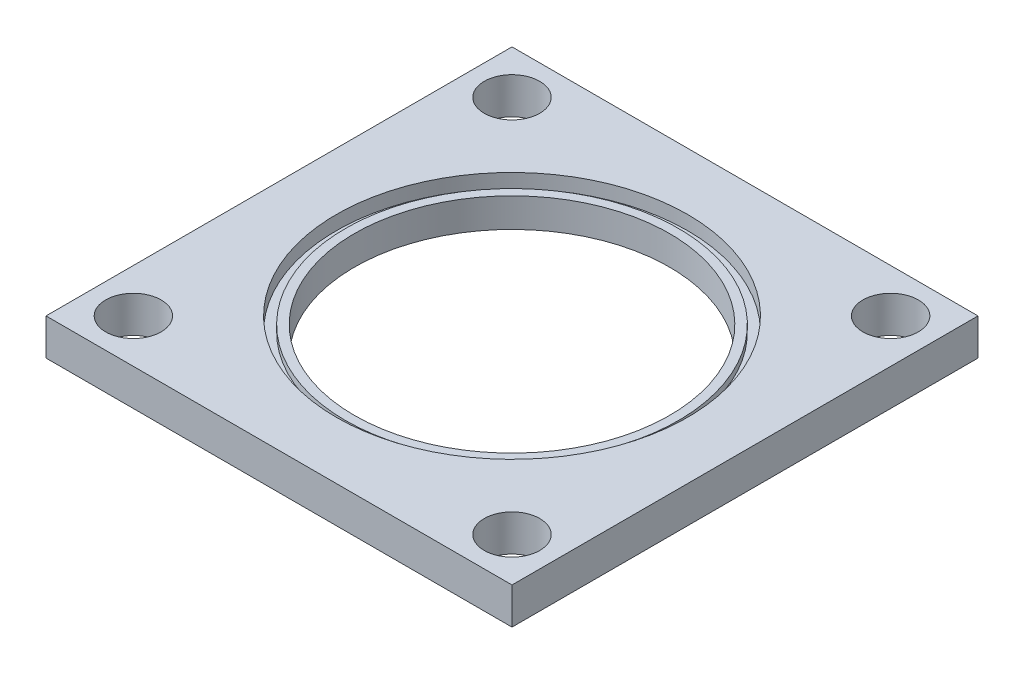
ISO-10303-21;
HEADER;
FILE_DESCRIPTION(('STEP AP214'),'2;1');
FILE_NAME('part.step','',(''),(''),'','','');
FILE_SCHEMA(('AUTOMOTIVE_DESIGN { 1 0 10303 214 1 1 1 1 }'));
ENDSEC;
DATA;
#1=APPLICATION_CONTEXT('core data for automotive mechanical design processes');
#2=APPLICATION_PROTOCOL_DEFINITION('international standard','automotive_design',2000,#1);
#3=PRODUCT_CONTEXT('',#1,'mechanical');
#4=PRODUCT('Part','Part','',(#3));
#5=PRODUCT_RELATED_PRODUCT_CATEGORY('part','',(#4));
#6=PRODUCT_DEFINITION_FORMATION('','',#4);
#7=PRODUCT_DEFINITION_CONTEXT('part definition',#1,'design');
#8=PRODUCT_DEFINITION('design','',#6,#7);
#9=PRODUCT_DEFINITION_SHAPE('','',#8);
#10=(LENGTH_UNIT() NAMED_UNIT(*) SI_UNIT(.MILLI.,.METRE.));
#11=(NAMED_UNIT(*) PLANE_ANGLE_UNIT() SI_UNIT($,.RADIAN.));
#12=(NAMED_UNIT(*) SI_UNIT($,.STERADIAN.) SOLID_ANGLE_UNIT());
#13=UNCERTAINTY_MEASURE_WITH_UNIT(LENGTH_MEASURE(1.E-05),#10,'distance_accuracy_value','');
#14=(GEOMETRIC_REPRESENTATION_CONTEXT(3) GLOBAL_UNCERTAINTY_ASSIGNED_CONTEXT((#13)) GLOBAL_UNIT_ASSIGNED_CONTEXT((#10,
#11,#12)) REPRESENTATION_CONTEXT('',''));
#15=CARTESIAN_POINT('',(0.,0.,0.));
#16=DIRECTION('',(0.,0.,1.));
#17=DIRECTION('',(1.,0.,0.));
#18=AXIS2_PLACEMENT_3D('',#15,#16,#17);
#19=CARTESIAN_POINT('',(0.,5.,0.));
#20=DIRECTION('',(0.,1.,0.));
#21=DIRECTION('',(0.,0.,1.));
#22=AXIS2_PLACEMENT_3D('',#19,#20,#21);
#23=PLANE('',#22);
#24=CARTESIAN_POINT('',(0.,5.,0.));
#25=DIRECTION('',(0.,1.,0.));
#26=DIRECTION('',(0.,0.,1.));
#27=AXIS2_PLACEMENT_3D('',#24,#25,#26);
#28=CIRCLE('',#27,27.051);
#29=CARTESIAN_POINT('',(0.,5.,27.051));
#30=VERTEX_POINT('',#29);
#31=EDGE_CURVE('E163',#30,#30,#28,.T.);
#32=ORIENTED_EDGE('',*,*,#31,.F.);
#33=EDGE_LOOP('',(#32));
#34=FACE_BOUND('',#33,.T.);
#35=CARTESIAN_POINT('',(0.,5.,0.));
#36=DIRECTION('',(0.,1.,0.));
#37=DIRECTION('',(0.,0.,1.));
#38=AXIS2_PLACEMENT_3D('',#35,#36,#37);
#39=CIRCLE('',#38,28.575);
#40=CARTESIAN_POINT('',(0.,5.,28.575));
#41=VERTEX_POINT('',#40);
#42=EDGE_CURVE('E208',#41,#41,#39,.T.);
#43=ORIENTED_EDGE('',*,*,#42,.T.);
#44=EDGE_LOOP('',(#43));
#45=FACE_BOUND('',#44,.T.);
#46=ADVANCED_FACE('F51',(#34,#45),#23,.T.);
#47=CARTESIAN_POINT('',(0.,0.,0.));
#48=DIRECTION('',(0.,-1.,0.));
#49=DIRECTION('',(0.,0.,-1.));
#50=AXIS2_PLACEMENT_3D('',#47,#48,#49);
#51=PLANE('',#50);
#52=CARTESIAN_POINT('',(-32.5,0.,32.5));
#53=DIRECTION('',(0.,1.,0.));
#54=DIRECTION('',(0.,0.,1.));
#55=AXIS2_PLACEMENT_3D('',#52,#53,#54);
#56=CIRCLE('',#55,4.7625);
#57=CARTESIAN_POINT('',(-32.5,0.,37.2625));
#58=VERTEX_POINT('',#57);
#59=EDGE_CURVE('E174',#58,#58,#56,.T.);
#60=ORIENTED_EDGE('',*,*,#59,.T.);
#61=EDGE_LOOP('',(#60));
#62=FACE_BOUND('',#61,.T.);
#63=CARTESIAN_POINT('',(32.5,0.,-32.5));
#64=DIRECTION('',(0.,1.,0.));
#65=DIRECTION('',(0.,0.,1.));
#66=AXIS2_PLACEMENT_3D('',#63,#64,#65);
#67=CIRCLE('',#66,4.7625);
#68=CARTESIAN_POINT('',(32.5,0.,-27.7375));
#69=VERTEX_POINT('',#68);
#70=EDGE_CURVE('E186',#69,#69,#67,.T.);
#71=ORIENTED_EDGE('',*,*,#70,.T.);
#72=EDGE_LOOP('',(#71));
#73=FACE_BOUND('',#72,.T.);
#74=DIRECTION('',(0.,0.,-1.));
#75=VECTOR('',#74,1.);
#76=CARTESIAN_POINT('',(-40.,0.,40.));
#77=LINE('',#76,#75);
#78=CARTESIAN_POINT('',(-40.,0.,40.));
#79=VERTEX_POINT('',#78);
#80=CARTESIAN_POINT('',(-40.,0.,-40.));
#81=VERTEX_POINT('',#80);
#82=EDGE_CURVE('E130',#79,#81,#77,.T.);
#83=ORIENTED_EDGE('',*,*,#82,.T.);
#84=DIRECTION('',(1.,0.,0.));
#85=VECTOR('',#84,1.);
#86=CARTESIAN_POINT('',(-40.,0.,-40.));
#87=LINE('',#86,#85);
#88=CARTESIAN_POINT('',(40.,0.,-40.));
#89=VERTEX_POINT('',#88);
#90=EDGE_CURVE('E134',#81,#89,#87,.T.);
#91=ORIENTED_EDGE('',*,*,#90,.T.);
#92=DIRECTION('',(0.,0.,-1.));
#93=VECTOR('',#92,1.);
#94=CARTESIAN_POINT('',(40.,0.,40.));
#95=LINE('',#94,#93);
#96=CARTESIAN_POINT('',(40.,0.,40.));
#97=VERTEX_POINT('',#96);
#98=EDGE_CURVE('E115',#97,#89,#95,.T.);
#99=ORIENTED_EDGE('',*,*,#98,.F.);
#100=DIRECTION('',(1.,0.,0.));
#101=VECTOR('',#100,1.);
#102=CARTESIAN_POINT('',(-40.,0.,40.));
#103=LINE('',#102,#101);
#104=EDGE_CURVE('E87',#79,#97,#103,.T.);
#105=ORIENTED_EDGE('',*,*,#104,.F.);
#106=EDGE_LOOP('',(#83,#91,#99,#105));
#107=FACE_BOUND('',#106,.T.);
#108=CARTESIAN_POINT('',(-32.5,0.,-32.5));
#109=DIRECTION('',(0.,1.,0.));
#110=DIRECTION('',(0.,0.,1.));
#111=AXIS2_PLACEMENT_3D('',#108,#109,#110);
#112=CIRCLE('',#111,4.7625);
#113=CARTESIAN_POINT('',(-32.5,0.,-27.7375));
#114=VERTEX_POINT('',#113);
#115=EDGE_CURVE('E153',#114,#114,#112,.T.);
#116=ORIENTED_EDGE('',*,*,#115,.T.);
#117=EDGE_LOOP('',(#116));
#118=FACE_BOUND('',#117,.T.);
#119=CARTESIAN_POINT('',(32.5,0.,32.5));
#120=DIRECTION('',(0.,1.,0.));
#121=DIRECTION('',(0.,0.,1.));
#122=AXIS2_PLACEMENT_3D('',#119,#120,#121);
#123=CIRCLE('',#122,4.7625);
#124=CARTESIAN_POINT('',(32.5,0.,37.2625));
#125=VERTEX_POINT('',#124);
#126=EDGE_CURVE('E157',#125,#125,#123,.T.);
#127=ORIENTED_EDGE('',*,*,#126,.T.);
#128=EDGE_LOOP('',(#127));
#129=FACE_BOUND('',#128,.T.);
#130=CARTESIAN_POINT('',(0.,0.,0.));
#131=DIRECTION('',(0.,1.,0.));
#132=DIRECTION('',(0.,0.,1.));
#133=AXIS2_PLACEMENT_3D('',#130,#131,#132);
#134=CIRCLE('',#133,27.051);
#135=CARTESIAN_POINT('',(0.,0.,27.051));
#136=VERTEX_POINT('',#135);
#137=EDGE_CURVE('E160',#136,#136,#134,.T.);
#138=ORIENTED_EDGE('',*,*,#137,.T.);
#139=EDGE_LOOP('',(#138));
#140=FACE_BOUND('',#139,.T.);
#141=ADVANCED_FACE('F145',(#62,#73,#107,#118,#129,#140),#51,.T.);
#142=CARTESIAN_POINT('',(0.,6.2738,0.));
#143=DIRECTION('',(0.,-1.,0.));
#144=DIRECTION('',(0.,0.,-1.));
#145=AXIS2_PLACEMENT_3D('',#142,#143,#144);
#146=PLANE('',#145);
#147=CARTESIAN_POINT('',(-32.5,6.2738,32.5));
#148=DIRECTION('',(0.,-1.,0.));
#149=DIRECTION('',(0.,0.,-1.));
#150=AXIS2_PLACEMENT_3D('',#147,#148,#149);
#151=CIRCLE('',#150,4.7625);
#152=CARTESIAN_POINT('',(-32.5,6.2738,27.7375));
#153=VERTEX_POINT('',#152);
#154=EDGE_CURVE('E177',#153,#153,#151,.F.);
#155=ORIENTED_EDGE('',*,*,#154,.F.);
#156=EDGE_LOOP('',(#155));
#157=FACE_BOUND('',#156,.T.);
#158=CARTESIAN_POINT('',(32.5,6.2738,-32.5));
#159=DIRECTION('',(0.,-1.,0.));
#160=DIRECTION('',(0.,0.,-1.));
#161=AXIS2_PLACEMENT_3D('',#158,#159,#160);
#162=CIRCLE('',#161,4.7625);
#163=CARTESIAN_POINT('',(32.5,6.2738,-37.2625));
#164=VERTEX_POINT('',#163);
#165=EDGE_CURVE('E189',#164,#164,#162,.F.);
#166=ORIENTED_EDGE('',*,*,#165,.F.);
#167=EDGE_LOOP('',(#166));
#168=FACE_BOUND('',#167,.T.);
#169=DIRECTION('',(0.,0.,-1.));
#170=VECTOR('',#169,1.);
#171=CARTESIAN_POINT('',(-40.,6.2738,40.));
#172=LINE('',#171,#170);
#173=CARTESIAN_POINT('',(-40.,6.2738,40.));
#174=VERTEX_POINT('',#173);
#175=CARTESIAN_POINT('',(-40.,6.2738,-40.));
#176=VERTEX_POINT('',#175);
#177=EDGE_CURVE('E120',#174,#176,#172,.T.);
#178=ORIENTED_EDGE('',*,*,#177,.F.);
#179=DIRECTION('',(1.,0.,0.));
#180=VECTOR('',#179,1.);
#181=CARTESIAN_POINT('',(-40.,6.2738,40.));
#182=LINE('',#181,#180);
#183=CARTESIAN_POINT('',(40.,6.2738,40.));
#184=VERTEX_POINT('',#183);
#185=EDGE_CURVE('E107',#174,#184,#182,.T.);
#186=ORIENTED_EDGE('',*,*,#185,.T.);
#187=DIRECTION('',(0.,0.,-1.));
#188=VECTOR('',#187,1.);
#189=CARTESIAN_POINT('',(40.,6.2738,40.));
#190=LINE('',#189,#188);
#191=CARTESIAN_POINT('',(40.,6.2738,-40.));
#192=VERTEX_POINT('',#191);
#193=EDGE_CURVE('E101',#184,#192,#190,.T.);
#194=ORIENTED_EDGE('',*,*,#193,.T.);
#195=DIRECTION('',(1.,0.,0.));
#196=VECTOR('',#195,1.);
#197=CARTESIAN_POINT('',(-40.,6.2738,-40.));
#198=LINE('',#197,#196);
#199=EDGE_CURVE('E106',#176,#192,#198,.T.);
#200=ORIENTED_EDGE('',*,*,#199,.F.);
#201=EDGE_LOOP('',(#178,#186,#194,#200));
#202=FACE_BOUND('',#201,.T.);
#203=CARTESIAN_POINT('',(-32.5,6.2738,-32.5));
#204=DIRECTION('',(0.,-1.,0.));
#205=DIRECTION('',(0.,0.,-1.));
#206=AXIS2_PLACEMENT_3D('',#203,#204,#205);
#207=CIRCLE('',#206,4.7625);
#208=CARTESIAN_POINT('',(-32.5,6.2738,-37.2625));
#209=VERTEX_POINT('',#208);
#210=EDGE_CURVE('E135',#209,#209,#207,.F.);
#211=ORIENTED_EDGE('',*,*,#210,.F.);
#212=EDGE_LOOP('',(#211));
#213=FACE_BOUND('',#212,.T.);
#214=CARTESIAN_POINT('',(32.5,6.2738,32.5));
#215=DIRECTION('',(0.,-1.,0.));
#216=DIRECTION('',(0.,0.,-1.));
#217=AXIS2_PLACEMENT_3D('',#214,#215,#216);
#218=CIRCLE('',#217,4.7625);
#219=CARTESIAN_POINT('',(32.5,6.2738,27.7375));
#220=VERTEX_POINT('',#219);
#221=EDGE_CURVE('E182',#220,#220,#218,.F.);
#222=ORIENTED_EDGE('',*,*,#221,.F.);
#223=EDGE_LOOP('',(#222));
#224=FACE_BOUND('',#223,.T.);
#225=CARTESIAN_POINT('',(0.,6.2738,0.));
#226=DIRECTION('',(0.,-1.,0.));
#227=DIRECTION('',(0.,0.,-1.));
#228=AXIS2_PLACEMENT_3D('',#225,#226,#227);
#229=CIRCLE('',#228,30.1625);
#230=CARTESIAN_POINT('',(0.,6.2738,-30.1625));
#231=VERTEX_POINT('',#230);
#232=EDGE_CURVE('E55',#231,#231,#229,.F.);
#233=ORIENTED_EDGE('',*,*,#232,.F.);
#234=EDGE_LOOP('',(#233));
#235=FACE_BOUND('',#234,.T.);
#236=ADVANCED_FACE('F104',(#157,#168,#202,#213,#224,#235),#146,.F.);
#237=CARTESIAN_POINT('',(-40.,6.2738,40.));
#238=DIRECTION('',(-1.,0.,0.));
#239=DIRECTION('',(0.,0.,1.));
#240=AXIS2_PLACEMENT_3D('',#237,#238,#239);
#241=PLANE('',#240);
#242=ORIENTED_EDGE('',*,*,#82,.F.);
#243=DIRECTION('',(0.,-1.,0.));
#244=VECTOR('',#243,1.);
#245=CARTESIAN_POINT('',(-40.,6.2738,40.));
#246=LINE('',#245,#244);
#247=EDGE_CURVE('E13',#174,#79,#246,.T.);
#248=ORIENTED_EDGE('',*,*,#247,.F.);
#249=ORIENTED_EDGE('',*,*,#177,.T.);
#250=DIRECTION('',(0.,-1.,0.));
#251=VECTOR('',#250,1.);
#252=CARTESIAN_POINT('',(-40.,6.2738,-40.));
#253=LINE('',#252,#251);
#254=EDGE_CURVE('E96',#176,#81,#253,.T.);
#255=ORIENTED_EDGE('',*,*,#254,.T.);
#256=EDGE_LOOP('',(#242,#248,#249,#255));
#257=FACE_BOUND('',#256,.T.);
#258=ADVANCED_FACE('F53',(#257),#241,.T.);
#259=CARTESIAN_POINT('',(-40.,6.2738,40.));
#260=DIRECTION('',(0.,0.,-1.));
#261=DIRECTION('',(-1.,0.,0.));
#262=AXIS2_PLACEMENT_3D('',#259,#260,#261);
#263=PLANE('',#262);
#264=ORIENTED_EDGE('',*,*,#104,.T.);
#265=DIRECTION('',(0.,-1.,0.));
#266=VECTOR('',#265,1.);
#267=CARTESIAN_POINT('',(40.,6.2738,40.));
#268=LINE('',#267,#266);
#269=EDGE_CURVE('E61',#184,#97,#268,.T.);
#270=ORIENTED_EDGE('',*,*,#269,.F.);
#271=ORIENTED_EDGE('',*,*,#185,.F.);
#272=ORIENTED_EDGE('',*,*,#247,.T.);
#273=EDGE_LOOP('',(#264,#270,#271,#272));
#274=FACE_BOUND('',#273,.T.);
#275=ADVANCED_FACE('F295',(#274),#263,.F.);
#276=CARTESIAN_POINT('',(40.,6.2738,40.));
#277=DIRECTION('',(-1.,0.,0.));
#278=DIRECTION('',(0.,0.,1.));
#279=AXIS2_PLACEMENT_3D('',#276,#277,#278);
#280=PLANE('',#279);
#281=ORIENTED_EDGE('',*,*,#98,.T.);
#282=DIRECTION('',(0.,-1.,0.));
#283=VECTOR('',#282,1.);
#284=CARTESIAN_POINT('',(40.,6.2738,-40.));
#285=LINE('',#284,#283);
#286=EDGE_CURVE('E112',#192,#89,#285,.T.);
#287=ORIENTED_EDGE('',*,*,#286,.F.);
#288=ORIENTED_EDGE('',*,*,#193,.F.);
#289=ORIENTED_EDGE('',*,*,#269,.T.);
#290=EDGE_LOOP('',(#281,#287,#288,#289));
#291=FACE_BOUND('',#290,.T.);
#292=ADVANCED_FACE('F113',(#291),#280,.F.);
#293=CARTESIAN_POINT('',(-40.,6.2738,-40.));
#294=DIRECTION('',(0.,0.,-1.));
#295=DIRECTION('',(-1.,0.,0.));
#296=AXIS2_PLACEMENT_3D('',#293,#294,#295);
#297=PLANE('',#296);
#298=ORIENTED_EDGE('',*,*,#90,.F.);
#299=ORIENTED_EDGE('',*,*,#254,.F.);
#300=ORIENTED_EDGE('',*,*,#199,.T.);
#301=ORIENTED_EDGE('',*,*,#286,.T.);
#302=EDGE_LOOP('',(#298,#299,#300,#301));
#303=FACE_BOUND('',#302,.T.);
#304=ADVANCED_FACE('F118',(#303),#297,.T.);
#305=CARTESIAN_POINT('',(-32.5,10.,-32.5));
#306=DIRECTION('',(0.,-1.,0.));
#307=DIRECTION('',(0.,0.,-1.));
#308=AXIS2_PLACEMENT_3D('',#305,#306,#307);
#309=CYLINDRICAL_SURFACE('',#308,4.7625);
#310=ORIENTED_EDGE('',*,*,#115,.F.);
#311=EDGE_LOOP('',(#310));
#312=FACE_BOUND('',#311,.T.);
#313=ORIENTED_EDGE('',*,*,#210,.T.);
#314=EDGE_LOOP('',(#313));
#315=FACE_BOUND('',#314,.T.);
#316=ADVANCED_FACE('F196',(#312,#315),#309,.F.);
#317=CARTESIAN_POINT('',(32.5,10.,-32.5));
#318=DIRECTION('',(0.,-1.,0.));
#319=DIRECTION('',(0.,0.,-1.));
#320=AXIS2_PLACEMENT_3D('',#317,#318,#319);
#321=CYLINDRICAL_SURFACE('',#320,4.7625);
#322=ORIENTED_EDGE('',*,*,#70,.F.);
#323=EDGE_LOOP('',(#322));
#324=FACE_BOUND('',#323,.T.);
#325=ORIENTED_EDGE('',*,*,#165,.T.);
#326=EDGE_LOOP('',(#325));
#327=FACE_BOUND('',#326,.T.);
#328=ADVANCED_FACE('F285',(#324,#327),#321,.F.);
#329=CARTESIAN_POINT('',(32.5,10.,32.5));
#330=DIRECTION('',(0.,-1.,0.));
#331=DIRECTION('',(0.,0.,-1.));
#332=AXIS2_PLACEMENT_3D('',#329,#330,#331);
#333=CYLINDRICAL_SURFACE('',#332,4.7625);
#334=ORIENTED_EDGE('',*,*,#126,.F.);
#335=EDGE_LOOP('',(#334));
#336=FACE_BOUND('',#335,.T.);
#337=ORIENTED_EDGE('',*,*,#221,.T.);
#338=EDGE_LOOP('',(#337));
#339=FACE_BOUND('',#338,.T.);
#340=ADVANCED_FACE('F236',(#336,#339),#333,.F.);
#341=CARTESIAN_POINT('',(-32.5,10.,32.5));
#342=DIRECTION('',(0.,-1.,0.));
#343=DIRECTION('',(0.,0.,-1.));
#344=AXIS2_PLACEMENT_3D('',#341,#342,#343);
#345=CYLINDRICAL_SURFACE('',#344,4.7625);
#346=ORIENTED_EDGE('',*,*,#59,.F.);
#347=EDGE_LOOP('',(#346));
#348=FACE_BOUND('',#347,.T.);
#349=ORIENTED_EDGE('',*,*,#154,.T.);
#350=EDGE_LOOP('',(#349));
#351=FACE_BOUND('',#350,.T.);
#352=ADVANCED_FACE('F228',(#348,#351),#345,.F.);
#353=CARTESIAN_POINT('',(0.,10.,0.));
#354=DIRECTION('',(0.,-1.,0.));
#355=DIRECTION('',(0.,0.,-1.));
#356=AXIS2_PLACEMENT_3D('',#353,#354,#355);
#357=CYLINDRICAL_SURFACE('',#356,30.1625);
#358=ORIENTED_EDGE('',*,*,#232,.T.);
#359=EDGE_LOOP('',(#358));
#360=FACE_BOUND('',#359,.T.);
#361=CARTESIAN_POINT('',(0.,3.857,0.));
#362=DIRECTION('',(0.,1.,0.));
#363=DIRECTION('',(0.,0.,1.));
#364=AXIS2_PLACEMENT_3D('',#361,#362,#363);
#365=CIRCLE('',#364,30.1625);
#366=CARTESIAN_POINT('',(0.,3.857,30.1625));
#367=VERTEX_POINT('',#366);
#368=EDGE_CURVE('E164',#367,#367,#365,.T.);
#369=ORIENTED_EDGE('',*,*,#368,.F.);
#370=EDGE_LOOP('',(#369));
#371=FACE_BOUND('',#370,.T.);
#372=ADVANCED_FACE('F226',(#360,#371),#357,.F.);
#373=CARTESIAN_POINT('',(0.,5.,0.));
#374=DIRECTION('',(0.,-1.,0.));
#375=DIRECTION('',(0.,0.,-1.));
#376=AXIS2_PLACEMENT_3D('',#373,#374,#375);
#377=CYLINDRICAL_SURFACE('',#376,27.051);
#378=ORIENTED_EDGE('',*,*,#31,.T.);
#379=EDGE_LOOP('',(#378));
#380=FACE_BOUND('',#379,.T.);
#381=ORIENTED_EDGE('',*,*,#137,.F.);
#382=EDGE_LOOP('',(#381));
#383=FACE_BOUND('',#382,.T.);
#384=ADVANCED_FACE('F222',(#380,#383),#377,.F.);
#385=CARTESIAN_POINT('',(0.,3.857,0.));
#386=DIRECTION('',(0.,1.,0.));
#387=DIRECTION('',(0.,0.,1.));
#388=AXIS2_PLACEMENT_3D('',#385,#386,#387);
#389=PLANE('',#388);
#390=CARTESIAN_POINT('',(0.,3.857,0.));
#391=DIRECTION('',(0.,1.,0.));
#392=DIRECTION('',(0.,0.,1.));
#393=AXIS2_PLACEMENT_3D('',#390,#391,#392);
#394=CIRCLE('',#393,28.575);
#395=CARTESIAN_POINT('',(0.,3.857,28.575));
#396=VERTEX_POINT('',#395);
#397=EDGE_CURVE('E171',#396,#396,#394,.T.);
#398=ORIENTED_EDGE('',*,*,#397,.F.);
#399=EDGE_LOOP('',(#398));
#400=FACE_BOUND('',#399,.T.);
#401=ORIENTED_EDGE('',*,*,#368,.T.);
#402=EDGE_LOOP('',(#401));
#403=FACE_BOUND('',#402,.T.);
#404=ADVANCED_FACE('F219',(#400,#403),#389,.T.);
#405=CARTESIAN_POINT('',(0.,3.857,0.));
#406=DIRECTION('',(0.,1.,0.));
#407=DIRECTION('',(0.,0.,1.));
#408=AXIS2_PLACEMENT_3D('',#405,#406,#407);
#409=CYLINDRICAL_SURFACE('',#408,28.575);
#410=ORIENTED_EDGE('',*,*,#397,.T.);
#411=EDGE_LOOP('',(#410));
#412=FACE_BOUND('',#411,.T.);
#413=ORIENTED_EDGE('',*,*,#42,.F.);
#414=EDGE_LOOP('',(#413));
#415=FACE_BOUND('',#414,.T.);
#416=ADVANCED_FACE('F216',(#412,#415),#409,.T.);
#417=CLOSED_SHELL('',(#46,#141,#236,#258,#275,#292,#304,#316,#328,#340,#352,#372,#384,#404,#416));
#418=MANIFOLD_SOLID_BREP('B2',#417);
#419=ADVANCED_BREP_SHAPE_REPRESENTATION('',(#18,#418),#14);
#420=SHAPE_DEFINITION_REPRESENTATION(#9,#419);
ENDSEC;
END-ISO-10303-21;
